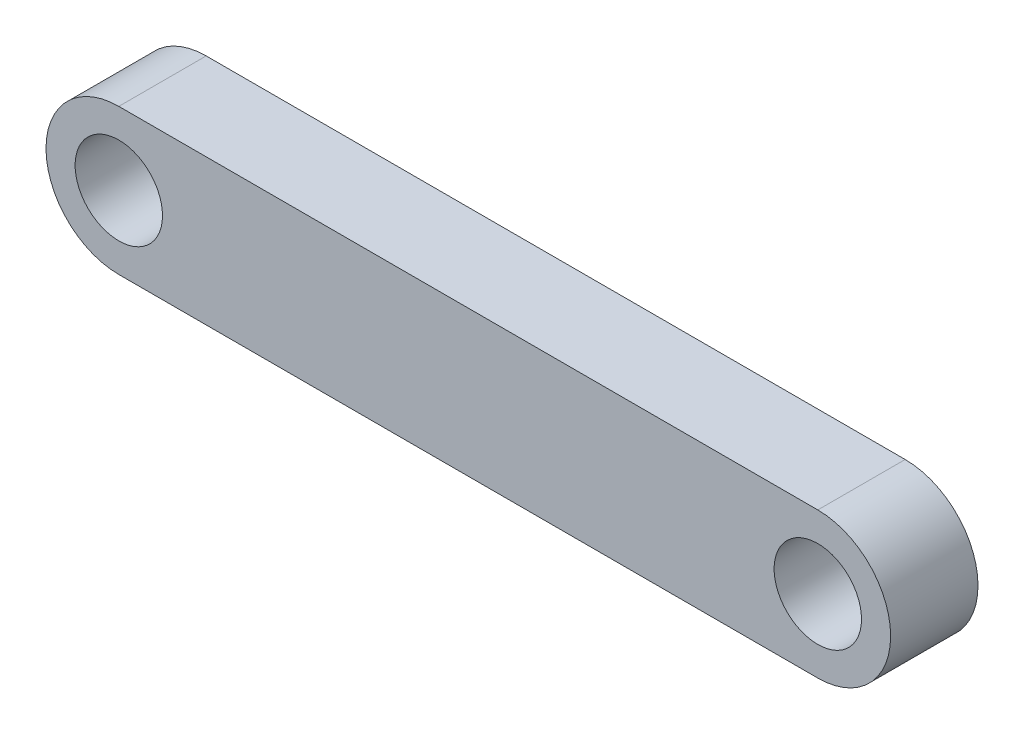
ISO-10303-21;
HEADER;
FILE_DESCRIPTION(('STEP AP214'),'2;1');
FILE_NAME('part.step','',(''),(''),'','','');
FILE_SCHEMA(('AUTOMOTIVE_DESIGN { 1 0 10303 214 1 1 1 1 }'));
ENDSEC;
DATA;
#1=APPLICATION_CONTEXT('core data for automotive mechanical design processes');
#2=APPLICATION_PROTOCOL_DEFINITION('international standard','automotive_design',2000,#1);
#3=PRODUCT_CONTEXT('',#1,'mechanical');
#4=PRODUCT('Part','Part','',(#3));
#5=PRODUCT_RELATED_PRODUCT_CATEGORY('part','',(#4));
#6=PRODUCT_DEFINITION_FORMATION('','',#4);
#7=PRODUCT_DEFINITION_CONTEXT('part definition',#1,'design');
#8=PRODUCT_DEFINITION('design','',#6,#7);
#9=PRODUCT_DEFINITION_SHAPE('','',#8);
#10=(LENGTH_UNIT() NAMED_UNIT(*) SI_UNIT(.MILLI.,.METRE.));
#11=(NAMED_UNIT(*) PLANE_ANGLE_UNIT() SI_UNIT($,.RADIAN.));
#12=(NAMED_UNIT(*) SI_UNIT($,.STERADIAN.) SOLID_ANGLE_UNIT());
#13=UNCERTAINTY_MEASURE_WITH_UNIT(LENGTH_MEASURE(1.E-05),#10,'distance_accuracy_value','');
#14=(GEOMETRIC_REPRESENTATION_CONTEXT(3) GLOBAL_UNCERTAINTY_ASSIGNED_CONTEXT((#13)) GLOBAL_UNIT_ASSIGNED_CONTEXT((#10,
#11,#12)) REPRESENTATION_CONTEXT('',''));
#15=CARTESIAN_POINT('',(0.,0.,0.));
#16=DIRECTION('',(0.,0.,1.));
#17=DIRECTION('',(1.,0.,0.));
#18=AXIS2_PLACEMENT_3D('',#15,#16,#17);
#19=CARTESIAN_POINT('',(0.,5.,6.));
#20=DIRECTION('',(0.,1.,0.));
#21=DIRECTION('',(-1.,0.,0.));
#22=AXIS2_PLACEMENT_3D('',#19,#20,#21);
#23=PLANE('',#22);
#24=DIRECTION('',(1.,0.,0.));
#25=VECTOR('',#24,1.);
#26=CARTESIAN_POINT('',(0.,5.,0.));
#27=LINE('',#26,#25);
#28=CARTESIAN_POINT('',(0.,5.,0.));
#29=VERTEX_POINT('',#28);
#30=CARTESIAN_POINT('',(48.,5.,0.));
#31=VERTEX_POINT('',#30);
#32=EDGE_CURVE('E123',#29,#31,#27,.T.);
#33=ORIENTED_EDGE('',*,*,#32,.F.);
#34=DIRECTION('',(0.,0.,-1.));
#35=VECTOR('',#34,1.);
#36=CARTESIAN_POINT('',(0.,5.,6.));
#37=LINE('',#36,#35);
#38=CARTESIAN_POINT('',(0.,5.,6.));
#39=VERTEX_POINT('',#38);
#40=EDGE_CURVE('E11',#39,#29,#37,.T.);
#41=ORIENTED_EDGE('',*,*,#40,.F.);
#42=DIRECTION('',(1.,0.,0.));
#43=VECTOR('',#42,1.);
#44=CARTESIAN_POINT('',(0.,5.,6.));
#45=LINE('',#44,#43);
#46=CARTESIAN_POINT('',(48.,5.,6.));
#47=VERTEX_POINT('',#46);
#48=EDGE_CURVE('E99',#39,#47,#45,.T.);
#49=ORIENTED_EDGE('',*,*,#48,.T.);
#50=DIRECTION('',(0.,0.,-1.));
#51=VECTOR('',#50,1.);
#52=CARTESIAN_POINT('',(48.,5.,6.));
#53=LINE('',#52,#51);
#54=EDGE_CURVE('E87',#47,#31,#53,.T.);
#55=ORIENTED_EDGE('',*,*,#54,.T.);
#56=EDGE_LOOP('',(#33,#41,#49,#55));
#57=FACE_BOUND('',#56,.T.);
#58=ADVANCED_FACE('F47',(#57),#23,.T.);
#59=CARTESIAN_POINT('',(0.,0.,6.));
#60=DIRECTION('',(0.,0.,-1.));
#61=DIRECTION('',(-1.,0.,0.));
#62=AXIS2_PLACEMENT_3D('',#59,#60,#61);
#63=CYLINDRICAL_SURFACE('',#62,5.);
#64=CARTESIAN_POINT('',(0.,0.,0.));
#65=DIRECTION('',(0.,0.,1.));
#66=DIRECTION('',(1.,0.,0.));
#67=AXIS2_PLACEMENT_3D('',#64,#65,#66);
#68=CIRCLE('',#67,5.);
#69=CARTESIAN_POINT('',(0.,-5.,0.));
#70=VERTEX_POINT('',#69);
#71=EDGE_CURVE('E105',#29,#70,#68,.T.);
#72=ORIENTED_EDGE('',*,*,#71,.T.);
#73=DIRECTION('',(0.,0.,-1.));
#74=VECTOR('',#73,1.);
#75=CARTESIAN_POINT('',(0.,-5.,6.));
#76=LINE('',#75,#74);
#77=CARTESIAN_POINT('',(0.,-5.,6.));
#78=VERTEX_POINT('',#77);
#79=EDGE_CURVE('E56',#78,#70,#76,.T.);
#80=ORIENTED_EDGE('',*,*,#79,.F.);
#81=CARTESIAN_POINT('',(0.,0.,6.));
#82=DIRECTION('',(0.,0.,1.));
#83=DIRECTION('',(1.,0.,0.));
#84=AXIS2_PLACEMENT_3D('',#81,#82,#83);
#85=CIRCLE('',#84,5.);
#86=EDGE_CURVE('E93',#39,#78,#85,.T.);
#87=ORIENTED_EDGE('',*,*,#86,.F.);
#88=ORIENTED_EDGE('',*,*,#40,.T.);
#89=EDGE_LOOP('',(#72,#80,#87,#88));
#90=FACE_BOUND('',#89,.T.);
#91=ADVANCED_FACE('F103',(#90),#63,.T.);
#92=CARTESIAN_POINT('',(0.,-5.,6.));
#93=DIRECTION('',(0.,1.,0.));
#94=DIRECTION('',(-1.,0.,0.));
#95=AXIS2_PLACEMENT_3D('',#92,#93,#94);
#96=PLANE('',#95);
#97=DIRECTION('',(1.,0.,0.));
#98=VECTOR('',#97,1.);
#99=CARTESIAN_POINT('',(0.,-5.,0.));
#100=LINE('',#99,#98);
#101=CARTESIAN_POINT('',(48.,-5.,0.));
#102=VERTEX_POINT('',#101);
#103=EDGE_CURVE('E80',#70,#102,#100,.T.);
#104=ORIENTED_EDGE('',*,*,#103,.T.);
#105=DIRECTION('',(0.,0.,-1.));
#106=VECTOR('',#105,1.);
#107=CARTESIAN_POINT('',(48.,-5.,6.));
#108=LINE('',#107,#106);
#109=CARTESIAN_POINT('',(48.,-5.,6.));
#110=VERTEX_POINT('',#109);
#111=EDGE_CURVE('E107',#110,#102,#108,.T.);
#112=ORIENTED_EDGE('',*,*,#111,.F.);
#113=DIRECTION('',(1.,0.,0.));
#114=VECTOR('',#113,1.);
#115=CARTESIAN_POINT('',(0.,-5.,6.));
#116=LINE('',#115,#114);
#117=EDGE_CURVE('E98',#78,#110,#116,.T.);
#118=ORIENTED_EDGE('',*,*,#117,.F.);
#119=ORIENTED_EDGE('',*,*,#79,.T.);
#120=EDGE_LOOP('',(#104,#112,#118,#119));
#121=FACE_BOUND('',#120,.T.);
#122=ADVANCED_FACE('F108',(#121),#96,.F.);
#123=CARTESIAN_POINT('',(0.,0.,6.));
#124=DIRECTION('',(0.,0.,-1.));
#125=DIRECTION('',(-1.,0.,0.));
#126=AXIS2_PLACEMENT_3D('',#123,#124,#125);
#127=CYLINDRICAL_SURFACE('',#126,3.);
#128=CARTESIAN_POINT('',(0.,0.,6.));
#129=DIRECTION('',(0.,0.,1.));
#130=DIRECTION('',(1.,0.,0.));
#131=AXIS2_PLACEMENT_3D('',#128,#129,#130);
#132=CIRCLE('',#131,3.);
#133=CARTESIAN_POINT('',(3.,0.,6.));
#134=VERTEX_POINT('',#133);
#135=EDGE_CURVE('E112',#134,#134,#132,.T.);
#136=ORIENTED_EDGE('',*,*,#135,.T.);
#137=EDGE_LOOP('',(#136));
#138=FACE_BOUND('',#137,.T.);
#139=CARTESIAN_POINT('',(0.,0.,0.));
#140=DIRECTION('',(0.,0.,1.));
#141=DIRECTION('',(1.,0.,0.));
#142=AXIS2_PLACEMENT_3D('',#139,#140,#141);
#143=CIRCLE('',#142,3.);
#144=CARTESIAN_POINT('',(3.,0.,0.));
#145=VERTEX_POINT('',#144);
#146=EDGE_CURVE('E134',#145,#145,#143,.T.);
#147=ORIENTED_EDGE('',*,*,#146,.F.);
#148=EDGE_LOOP('',(#147));
#149=FACE_BOUND('',#148,.T.);
#150=ADVANCED_FACE('F158',(#138,#149),#127,.F.);
#151=CARTESIAN_POINT('',(48.,0.,6.));
#152=DIRECTION('',(0.,0.,-1.));
#153=DIRECTION('',(-1.,0.,0.));
#154=AXIS2_PLACEMENT_3D('',#151,#152,#153);
#155=CYLINDRICAL_SURFACE('',#154,5.);
#156=CARTESIAN_POINT('',(48.,0.,0.));
#157=DIRECTION('',(0.,0.,1.));
#158=DIRECTION('',(1.,0.,0.));
#159=AXIS2_PLACEMENT_3D('',#156,#157,#158);
#160=CIRCLE('',#159,5.);
#161=EDGE_CURVE('E131',#102,#31,#160,.T.);
#162=ORIENTED_EDGE('',*,*,#161,.T.);
#163=ORIENTED_EDGE('',*,*,#54,.F.);
#164=CARTESIAN_POINT('',(48.,0.,6.));
#165=DIRECTION('',(0.,0.,1.));
#166=DIRECTION('',(1.,0.,0.));
#167=AXIS2_PLACEMENT_3D('',#164,#165,#166);
#168=CIRCLE('',#167,5.);
#169=EDGE_CURVE('E64',#110,#47,#168,.T.);
#170=ORIENTED_EDGE('',*,*,#169,.F.);
#171=ORIENTED_EDGE('',*,*,#111,.T.);
#172=EDGE_LOOP('',(#162,#163,#170,#171));
#173=FACE_BOUND('',#172,.T.);
#174=ADVANCED_FACE('F147',(#173),#155,.T.);
#175=CARTESIAN_POINT('',(48.,0.,6.));
#176=DIRECTION('',(0.,0.,-1.));
#177=DIRECTION('',(-1.,0.,0.));
#178=AXIS2_PLACEMENT_3D('',#175,#176,#177);
#179=CYLINDRICAL_SURFACE('',#178,3.);
#180=CARTESIAN_POINT('',(48.,0.,6.));
#181=DIRECTION('',(0.,0.,1.));
#182=DIRECTION('',(1.,0.,0.));
#183=AXIS2_PLACEMENT_3D('',#180,#181,#182);
#184=CIRCLE('',#183,3.);
#185=CARTESIAN_POINT('',(51.,0.,6.));
#186=VERTEX_POINT('',#185);
#187=EDGE_CURVE('E119',#186,#186,#184,.T.);
#188=ORIENTED_EDGE('',*,*,#187,.T.);
#189=EDGE_LOOP('',(#188));
#190=FACE_BOUND('',#189,.T.);
#191=CARTESIAN_POINT('',(48.,0.,0.));
#192=DIRECTION('',(0.,0.,1.));
#193=DIRECTION('',(1.,0.,0.));
#194=AXIS2_PLACEMENT_3D('',#191,#192,#193);
#195=CIRCLE('',#194,3.);
#196=CARTESIAN_POINT('',(51.,0.,0.));
#197=VERTEX_POINT('',#196);
#198=EDGE_CURVE('E138',#197,#197,#195,.T.);
#199=ORIENTED_EDGE('',*,*,#198,.F.);
#200=EDGE_LOOP('',(#199));
#201=FACE_BOUND('',#200,.T.);
#202=ADVANCED_FACE('F163',(#190,#201),#179,.F.);
#203=CARTESIAN_POINT('',(0.,0.,6.));
#204=DIRECTION('',(0.,0.,1.));
#205=DIRECTION('',(1.,0.,0.));
#206=AXIS2_PLACEMENT_3D('',#203,#204,#205);
#207=PLANE('',#206);
#208=ORIENTED_EDGE('',*,*,#48,.F.);
#209=ORIENTED_EDGE('',*,*,#86,.T.);
#210=ORIENTED_EDGE('',*,*,#117,.T.);
#211=ORIENTED_EDGE('',*,*,#169,.T.);
#212=EDGE_LOOP('',(#208,#209,#210,#211));
#213=FACE_BOUND('',#212,.T.);
#214=ORIENTED_EDGE('',*,*,#135,.F.);
#215=EDGE_LOOP('',(#214));
#216=FACE_BOUND('',#215,.T.);
#217=ORIENTED_EDGE('',*,*,#187,.F.);
#218=EDGE_LOOP('',(#217));
#219=FACE_BOUND('',#218,.T.);
#220=ADVANCED_FACE('F95',(#213,#216,#219),#207,.T.);
#221=CARTESIAN_POINT('',(0.,0.,0.));
#222=DIRECTION('',(0.,0.,1.));
#223=DIRECTION('',(1.,0.,0.));
#224=AXIS2_PLACEMENT_3D('',#221,#222,#223);
#225=PLANE('',#224);
#226=ORIENTED_EDGE('',*,*,#32,.T.);
#227=ORIENTED_EDGE('',*,*,#161,.F.);
#228=ORIENTED_EDGE('',*,*,#103,.F.);
#229=ORIENTED_EDGE('',*,*,#71,.F.);
#230=EDGE_LOOP('',(#226,#227,#228,#229));
#231=FACE_BOUND('',#230,.T.);
#232=ORIENTED_EDGE('',*,*,#146,.T.);
#233=EDGE_LOOP('',(#232));
#234=FACE_BOUND('',#233,.T.);
#235=ORIENTED_EDGE('',*,*,#198,.T.);
#236=EDGE_LOOP('',(#235));
#237=FACE_BOUND('',#236,.T.);
#238=ADVANCED_FACE('F149',(#231,#234,#237),#225,.F.);
#239=CLOSED_SHELL('',(#58,#91,#122,#150,#174,#202,#220,#238));
#240=MANIFOLD_SOLID_BREP('B2',#239);
#241=ADVANCED_BREP_SHAPE_REPRESENTATION('',(#18,#240),#14);
#242=SHAPE_DEFINITION_REPRESENTATION(#9,#241);
ENDSEC;
END-ISO-10303-21;
